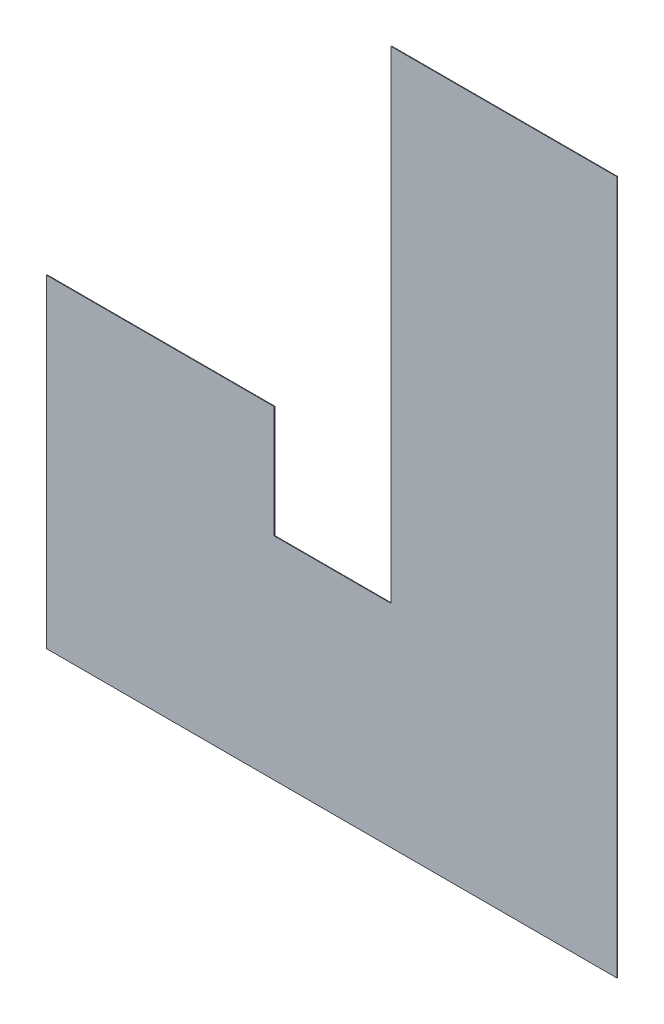
ISO-10303-21;
HEADER;
FILE_DESCRIPTION(('STEP AP214'),'2;1');
FILE_NAME('part.step','',(''),(''),'','','');
FILE_SCHEMA(('AUTOMOTIVE_DESIGN { 1 0 10303 214 1 1 1 1 }'));
ENDSEC;
DATA;
#1=APPLICATION_CONTEXT('core data for automotive mechanical design processes');
#2=APPLICATION_PROTOCOL_DEFINITION('international standard','automotive_design',2000,#1);
#3=PRODUCT_CONTEXT('',#1,'mechanical');
#4=PRODUCT('Part','Part','',(#3));
#5=PRODUCT_RELATED_PRODUCT_CATEGORY('part','',(#4));
#6=PRODUCT_DEFINITION_FORMATION('','',#4);
#7=PRODUCT_DEFINITION_CONTEXT('part definition',#1,'design');
#8=PRODUCT_DEFINITION('design','',#6,#7);
#9=PRODUCT_DEFINITION_SHAPE('','',#8);
#10=(LENGTH_UNIT() NAMED_UNIT(*) SI_UNIT(.MILLI.,.METRE.));
#11=(NAMED_UNIT(*) PLANE_ANGLE_UNIT() SI_UNIT($,.RADIAN.));
#12=(NAMED_UNIT(*) SI_UNIT($,.STERADIAN.) SOLID_ANGLE_UNIT());
#13=UNCERTAINTY_MEASURE_WITH_UNIT(LENGTH_MEASURE(1.E-05),#10,'distance_accuracy_value','');
#14=(GEOMETRIC_REPRESENTATION_CONTEXT(3) GLOBAL_UNCERTAINTY_ASSIGNED_CONTEXT((#13)) GLOBAL_UNIT_ASSIGNED_CONTEXT((#10,
#11,#12)) REPRESENTATION_CONTEXT('',''));
#15=CARTESIAN_POINT('',(0.,0.,0.));
#16=DIRECTION('',(0.,0.,1.));
#17=DIRECTION('',(1.,0.,0.));
#18=AXIS2_PLACEMENT_3D('',#15,#16,#17);
#19=CARTESIAN_POINT('',(0.,3307.48136658604,43842.9795491409));
#20=DIRECTION('',(0.,-1.,0.));
#21=DIRECTION('',(0.,0.,-1.));
#22=AXIS2_PLACEMENT_3D('',#19,#20,#21);
#23=PLANE('',#22);
#24=DIRECTION('',(-1.,0.,0.));
#25=VECTOR('',#24,1.);
#26=CARTESIAN_POINT('',(0.,3307.48136658604,43822.9795491409));
#27=LINE('',#26,#25);
#28=CARTESIAN_POINT('',(-7996.61768329129,3307.48136658604,43822.9795491409));
#29=VERTEX_POINT('',#28);
#30=CARTESIAN_POINT('',(-15606.6176832913,3307.48136658604,43822.9795491409));
#31=VERTEX_POINT('',#30);
#32=EDGE_CURVE('E135',#29,#31,#27,.T.);
#33=ORIENTED_EDGE('',*,*,#32,.T.);
#34=DIRECTION('',(0.,0.,-1.));
#35=VECTOR('',#34,1.);
#36=CARTESIAN_POINT('',(-15606.6176832913,3307.48136658604,43842.9795491409));
#37=LINE('',#36,#35);
#38=CARTESIAN_POINT('',(-15606.6176832913,3307.48136658604,43842.9795491409));
#39=VERTEX_POINT('',#38);
#40=EDGE_CURVE('E11',#39,#31,#37,.T.);
#41=ORIENTED_EDGE('',*,*,#40,.F.);
#42=DIRECTION('',(-1.,0.,0.));
#43=VECTOR('',#42,1.);
#44=CARTESIAN_POINT('',(0.,3307.48136658604,43842.9795491409));
#45=LINE('',#44,#43);
#46=CARTESIAN_POINT('',(-7996.61768329129,3307.48136658604,43842.9795491409));
#47=VERTEX_POINT('',#46);
#48=EDGE_CURVE('E153',#47,#39,#45,.T.);
#49=ORIENTED_EDGE('',*,*,#48,.F.);
#50=DIRECTION('',(0.,0.,-1.));
#51=VECTOR('',#50,1.);
#52=CARTESIAN_POINT('',(-7996.61768329129,3307.48136658604,43842.9795491409));
#53=LINE('',#52,#51);
#54=EDGE_CURVE('E55',#47,#29,#53,.T.);
#55=ORIENTED_EDGE('',*,*,#54,.T.);
#56=EDGE_LOOP('',(#33,#41,#49,#55));
#57=FACE_BOUND('',#56,.T.);
#58=ADVANCED_FACE('F39',(#57),#23,.F.);
#59=CARTESIAN_POINT('',(-15606.6176832913,-2.37049354951855E-12,43842.9795491409));
#60=DIRECTION('',(1.,0.,0.));
#61=DIRECTION('',(0.,1.,0.));
#62=AXIS2_PLACEMENT_3D('',#59,#60,#61);
#63=PLANE('',#62);
#64=DIRECTION('',(0.,-1.,0.));
#65=VECTOR('',#64,1.);
#66=CARTESIAN_POINT('',(-15606.6176832913,-2.37049354951855E-12,43822.9795491409));
#67=LINE('',#66,#65);
#68=CARTESIAN_POINT('',(-15606.6176832913,-12952.114633414,43822.9795491409));
#69=VERTEX_POINT('',#68);
#70=EDGE_CURVE('E137',#31,#69,#67,.T.);
#71=ORIENTED_EDGE('',*,*,#70,.T.);
#72=DIRECTION('',(0.,0.,-1.));
#73=VECTOR('',#72,1.);
#74=CARTESIAN_POINT('',(-15606.6176832913,-12952.114633414,43842.9795491409));
#75=LINE('',#74,#73);
#76=CARTESIAN_POINT('',(-15606.6176832913,-12952.114633414,43842.9795491409));
#77=VERTEX_POINT('',#76);
#78=EDGE_CURVE('E47',#77,#69,#75,.T.);
#79=ORIENTED_EDGE('',*,*,#78,.F.);
#80=DIRECTION('',(0.,-1.,0.));
#81=VECTOR('',#80,1.);
#82=CARTESIAN_POINT('',(-15606.6176832913,-2.37049354951855E-12,43842.9795491409));
#83=LINE('',#82,#81);
#84=EDGE_CURVE('E93',#39,#77,#83,.T.);
#85=ORIENTED_EDGE('',*,*,#84,.F.);
#86=ORIENTED_EDGE('',*,*,#40,.T.);
#87=EDGE_LOOP('',(#71,#79,#85,#86));
#88=FACE_BOUND('',#87,.T.);
#89=ADVANCED_FACE('F182',(#88),#63,.F.);
#90=CARTESIAN_POINT('',(0.,-12952.114633414,43842.9795491409));
#91=DIRECTION('',(0.,-1.,0.));
#92=DIRECTION('',(0.,0.,-1.));
#93=AXIS2_PLACEMENT_3D('',#90,#91,#92);
#94=PLANE('',#93);
#95=DIRECTION('',(-1.,0.,0.));
#96=VECTOR('',#95,1.);
#97=CARTESIAN_POINT('',(0.,-12952.114633414,43822.9795491409));
#98=LINE('',#97,#96);
#99=CARTESIAN_POINT('',(-19546.6176832913,-12952.114633414,43822.9795491409));
#100=VERTEX_POINT('',#99);
#101=EDGE_CURVE('E139',#69,#100,#98,.T.);
#102=ORIENTED_EDGE('',*,*,#101,.T.);
#103=DIRECTION('',(0.,0.,-1.));
#104=VECTOR('',#103,1.);
#105=CARTESIAN_POINT('',(-19546.6176832913,-12952.114633414,43842.9795491409));
#106=LINE('',#105,#104);
#107=CARTESIAN_POINT('',(-19546.6176832913,-12952.114633414,43842.9795491409));
#108=VERTEX_POINT('',#107);
#109=EDGE_CURVE('E159',#108,#100,#106,.T.);
#110=ORIENTED_EDGE('',*,*,#109,.F.);
#111=DIRECTION('',(-1.,0.,0.));
#112=VECTOR('',#111,1.);
#113=CARTESIAN_POINT('',(0.,-12952.114633414,43842.9795491409));
#114=LINE('',#113,#112);
#115=EDGE_CURVE('E167',#77,#108,#114,.T.);
#116=ORIENTED_EDGE('',*,*,#115,.F.);
#117=ORIENTED_EDGE('',*,*,#78,.T.);
#118=EDGE_LOOP('',(#102,#110,#116,#117));
#119=FACE_BOUND('',#118,.T.);
#120=ADVANCED_FACE('F165',(#119),#94,.F.);
#121=CARTESIAN_POINT('',(-19546.6176832913,0.,43842.9795491409));
#122=DIRECTION('',(-1.,0.,0.));
#123=DIRECTION('',(0.,0.,1.));
#124=AXIS2_PLACEMENT_3D('',#121,#122,#123);
#125=PLANE('',#124);
#126=DIRECTION('',(0.,1.,0.));
#127=VECTOR('',#126,1.);
#128=CARTESIAN_POINT('',(-19546.6176832913,0.,43822.9795491409));
#129=LINE('',#128,#127);
#130=CARTESIAN_POINT('',(-19546.6176832913,-9177.11463341396,43822.9795491409));
#131=VERTEX_POINT('',#130);
#132=EDGE_CURVE('E141',#100,#131,#129,.T.);
#133=ORIENTED_EDGE('',*,*,#132,.T.);
#134=DIRECTION('',(0.,0.,-1.));
#135=VECTOR('',#134,1.);
#136=CARTESIAN_POINT('',(-19546.6176832913,-9177.11463341396,43842.9795491409));
#137=LINE('',#136,#135);
#138=CARTESIAN_POINT('',(-19546.6176832913,-9177.11463341396,43842.9795491409));
#139=VERTEX_POINT('',#138);
#140=EDGE_CURVE('E157',#139,#131,#137,.T.);
#141=ORIENTED_EDGE('',*,*,#140,.F.);
#142=DIRECTION('',(0.,1.,0.));
#143=VECTOR('',#142,1.);
#144=CARTESIAN_POINT('',(-19546.6176832913,0.,43842.9795491409));
#145=LINE('',#144,#143);
#146=EDGE_CURVE('E176',#108,#139,#145,.T.);
#147=ORIENTED_EDGE('',*,*,#146,.F.);
#148=ORIENTED_EDGE('',*,*,#109,.T.);
#149=EDGE_LOOP('',(#133,#141,#147,#148));
#150=FACE_BOUND('',#149,.T.);
#151=ADVANCED_FACE('F174',(#150),#125,.F.);
#152=CARTESIAN_POINT('',(0.,-9177.11463341396,43842.9795491409));
#153=DIRECTION('',(0.,1.,0.));
#154=DIRECTION('',(0.,0.,1.));
#155=AXIS2_PLACEMENT_3D('',#152,#153,#154);
#156=PLANE('',#155);
#157=DIRECTION('',(1.,0.,0.));
#158=VECTOR('',#157,1.);
#159=CARTESIAN_POINT('',(0.,-9177.11463341396,43822.9795491409));
#160=LINE('',#159,#158);
#161=CARTESIAN_POINT('',(-27221.6176832913,-9177.11463341396,43822.9795491409));
#162=VERTEX_POINT('',#161);
#163=EDGE_CURVE('E144',#162,#131,#160,.T.);
#164=ORIENTED_EDGE('',*,*,#163,.F.);
#165=DIRECTION('',(0.,0.,-1.));
#166=VECTOR('',#165,1.);
#167=CARTESIAN_POINT('',(-27221.6176832913,-9177.11463341396,43842.9795491409));
#168=LINE('',#167,#166);
#169=CARTESIAN_POINT('',(-27221.6176832913,-9177.11463341396,43842.9795491409));
#170=VERTEX_POINT('',#169);
#171=EDGE_CURVE('E118',#170,#162,#168,.T.);
#172=ORIENTED_EDGE('',*,*,#171,.F.);
#173=DIRECTION('',(1.,0.,0.));
#174=VECTOR('',#173,1.);
#175=CARTESIAN_POINT('',(0.,-9177.11463341396,43842.9795491409));
#176=LINE('',#175,#174);
#177=EDGE_CURVE('E127',#170,#139,#176,.T.);
#178=ORIENTED_EDGE('',*,*,#177,.T.);
#179=ORIENTED_EDGE('',*,*,#140,.T.);
#180=EDGE_LOOP('',(#164,#172,#178,#179));
#181=FACE_BOUND('',#180,.T.);
#182=ADVANCED_FACE('F192',(#181),#156,.T.);
#183=CARTESIAN_POINT('',(-27221.6176832913,0.,43842.9795491409));
#184=DIRECTION('',(-1.,0.,0.));
#185=DIRECTION('',(0.,0.,1.));
#186=AXIS2_PLACEMENT_3D('',#183,#184,#185);
#187=PLANE('',#186);
#188=DIRECTION('',(0.,1.,0.));
#189=VECTOR('',#188,1.);
#190=CARTESIAN_POINT('',(-27221.6176832913,0.,43822.9795491409));
#191=LINE('',#190,#189);
#192=CARTESIAN_POINT('',(-27221.6176832913,-20082.518633414,43822.9795491409));
#193=VERTEX_POINT('',#192);
#194=EDGE_CURVE('E114',#193,#162,#191,.T.);
#195=ORIENTED_EDGE('',*,*,#194,.F.);
#196=DIRECTION('',(0.,0.,-1.));
#197=VECTOR('',#196,1.);
#198=CARTESIAN_POINT('',(-27221.6176832913,-20082.518633414,43842.9795491409));
#199=LINE('',#198,#197);
#200=CARTESIAN_POINT('',(-27221.6176832913,-20082.518633414,43842.9795491409));
#201=VERTEX_POINT('',#200);
#202=EDGE_CURVE('E109',#201,#193,#199,.T.);
#203=ORIENTED_EDGE('',*,*,#202,.F.);
#204=DIRECTION('',(0.,1.,0.));
#205=VECTOR('',#204,1.);
#206=CARTESIAN_POINT('',(-27221.6176832913,0.,43842.9795491409));
#207=LINE('',#206,#205);
#208=EDGE_CURVE('E112',#201,#170,#207,.T.);
#209=ORIENTED_EDGE('',*,*,#208,.T.);
#210=ORIENTED_EDGE('',*,*,#171,.T.);
#211=EDGE_LOOP('',(#195,#203,#209,#210));
#212=FACE_BOUND('',#211,.T.);
#213=ADVANCED_FACE('F111',(#212),#187,.T.);
#214=CARTESIAN_POINT('',(0.,-20082.518633414,43842.9795491409));
#215=DIRECTION('',(0.,-1.,0.));
#216=DIRECTION('',(0.,0.,-1.));
#217=AXIS2_PLACEMENT_3D('',#214,#215,#216);
#218=PLANE('',#217);
#219=DIRECTION('',(-1.,0.,0.));
#220=VECTOR('',#219,1.);
#221=CARTESIAN_POINT('',(0.,-20082.518633414,43822.9795491409));
#222=LINE('',#221,#220);
#223=CARTESIAN_POINT('',(-7996.61768329129,-20082.518633414,43822.9795491409));
#224=VERTEX_POINT('',#223);
#225=EDGE_CURVE('E148',#224,#193,#222,.T.);
#226=ORIENTED_EDGE('',*,*,#225,.F.);
#227=DIRECTION('',(0.,0.,-1.));
#228=VECTOR('',#227,1.);
#229=CARTESIAN_POINT('',(-7996.61768329129,-20082.518633414,43842.9795491409));
#230=LINE('',#229,#228);
#231=CARTESIAN_POINT('',(-7996.61768329129,-20082.518633414,43842.9795491409));
#232=VERTEX_POINT('',#231);
#233=EDGE_CURVE('E81',#232,#224,#230,.T.);
#234=ORIENTED_EDGE('',*,*,#233,.F.);
#235=DIRECTION('',(-1.,0.,0.));
#236=VECTOR('',#235,1.);
#237=CARTESIAN_POINT('',(0.,-20082.518633414,43842.9795491409));
#238=LINE('',#237,#236);
#239=EDGE_CURVE('E125',#232,#201,#238,.T.);
#240=ORIENTED_EDGE('',*,*,#239,.T.);
#241=ORIENTED_EDGE('',*,*,#202,.T.);
#242=EDGE_LOOP('',(#226,#234,#240,#241));
#243=FACE_BOUND('',#242,.T.);
#244=ADVANCED_FACE('F129',(#243),#218,.T.);
#245=CARTESIAN_POINT('',(-7996.61768329129,-9.10956381815956E-13,43842.9795491409));
#246=DIRECTION('',(1.,0.,0.));
#247=DIRECTION('',(0.,1.,0.));
#248=AXIS2_PLACEMENT_3D('',#245,#246,#247);
#249=PLANE('',#248);
#250=DIRECTION('',(0.,-1.,0.));
#251=VECTOR('',#250,1.);
#252=CARTESIAN_POINT('',(-7996.61768329129,-9.10956381815956E-13,43822.9795491409));
#253=LINE('',#252,#251);
#254=EDGE_CURVE('E150',#29,#224,#253,.T.);
#255=ORIENTED_EDGE('',*,*,#254,.F.);
#256=ORIENTED_EDGE('',*,*,#54,.F.);
#257=DIRECTION('',(0.,-1.,0.));
#258=VECTOR('',#257,1.);
#259=CARTESIAN_POINT('',(-7996.61768329129,-9.10956381815956E-13,43842.9795491409));
#260=LINE('',#259,#258);
#261=EDGE_CURVE('E130',#47,#232,#260,.T.);
#262=ORIENTED_EDGE('',*,*,#261,.T.);
#263=ORIENTED_EDGE('',*,*,#233,.T.);
#264=EDGE_LOOP('',(#255,#256,#262,#263));
#265=FACE_BOUND('',#264,.T.);
#266=ADVANCED_FACE('F200',(#265),#249,.T.);
#267=CARTESIAN_POINT('',(0.,0.,43842.9795491409));
#268=DIRECTION('',(0.,0.,1.));
#269=DIRECTION('',(1.,0.,0.));
#270=AXIS2_PLACEMENT_3D('',#267,#268,#269);
#271=PLANE('',#270);
#272=ORIENTED_EDGE('',*,*,#48,.T.);
#273=ORIENTED_EDGE('',*,*,#84,.T.);
#274=ORIENTED_EDGE('',*,*,#115,.T.);
#275=ORIENTED_EDGE('',*,*,#146,.T.);
#276=ORIENTED_EDGE('',*,*,#177,.F.);
#277=ORIENTED_EDGE('',*,*,#208,.F.);
#278=ORIENTED_EDGE('',*,*,#239,.F.);
#279=ORIENTED_EDGE('',*,*,#261,.F.);
#280=EDGE_LOOP('',(#272,#273,#274,#275,#276,#277,#278,#279));
#281=FACE_BOUND('',#280,.T.);
#282=ADVANCED_FACE('F123',(#281),#271,.T.);
#283=CARTESIAN_POINT('',(0.,0.,43822.9795491409));
#284=DIRECTION('',(0.,0.,1.));
#285=DIRECTION('',(1.,0.,0.));
#286=AXIS2_PLACEMENT_3D('',#283,#284,#285);
#287=PLANE('',#286);
#288=ORIENTED_EDGE('',*,*,#32,.F.);
#289=ORIENTED_EDGE('',*,*,#254,.T.);
#290=ORIENTED_EDGE('',*,*,#225,.T.);
#291=ORIENTED_EDGE('',*,*,#194,.T.);
#292=ORIENTED_EDGE('',*,*,#163,.T.);
#293=ORIENTED_EDGE('',*,*,#132,.F.);
#294=ORIENTED_EDGE('',*,*,#101,.F.);
#295=ORIENTED_EDGE('',*,*,#70,.F.);
#296=EDGE_LOOP('',(#288,#289,#290,#291,#292,#293,#294,#295));
#297=FACE_BOUND('',#296,.T.);
#298=ADVANCED_FACE('F170',(#297),#287,.F.);
#299=CLOSED_SHELL('',(#58,#89,#120,#151,#182,#213,#244,#266,#282,#298));
#300=MANIFOLD_SOLID_BREP('B2',#299);
#301=ADVANCED_BREP_SHAPE_REPRESENTATION('',(#18,#300),#14);
#302=SHAPE_DEFINITION_REPRESENTATION(#9,#301);
ENDSEC;
END-ISO-10303-21;
